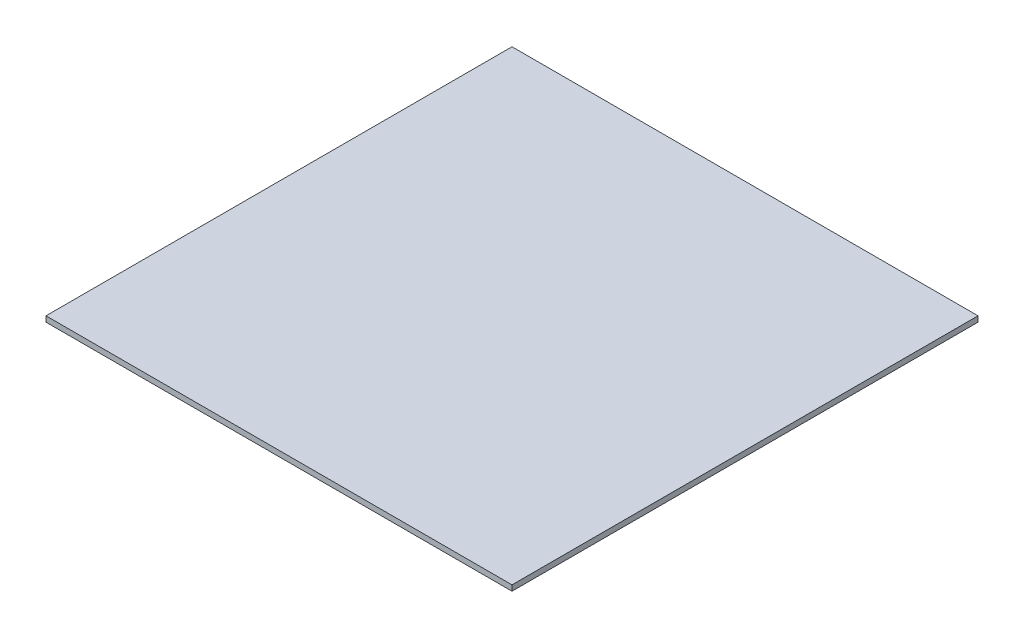
ISO-10303-21;
HEADER;
FILE_DESCRIPTION(('STEP AP214'),'2;1');
FILE_NAME('part.step','',(''),(''),'','','');
FILE_SCHEMA(('AUTOMOTIVE_DESIGN { 1 0 10303 214 1 1 1 1 }'));
ENDSEC;
DATA;
#1=APPLICATION_CONTEXT('core data for automotive mechanical design processes');
#2=APPLICATION_PROTOCOL_DEFINITION('international standard','automotive_design',2000,#1);
#3=PRODUCT_CONTEXT('',#1,'mechanical');
#4=PRODUCT('Part','Part','',(#3));
#5=PRODUCT_RELATED_PRODUCT_CATEGORY('part','',(#4));
#6=PRODUCT_DEFINITION_FORMATION('','',#4);
#7=PRODUCT_DEFINITION_CONTEXT('part definition',#1,'design');
#8=PRODUCT_DEFINITION('design','',#6,#7);
#9=PRODUCT_DEFINITION_SHAPE('','',#8);
#10=(LENGTH_UNIT() NAMED_UNIT(*) SI_UNIT(.MILLI.,.METRE.));
#11=(NAMED_UNIT(*) PLANE_ANGLE_UNIT() SI_UNIT($,.RADIAN.));
#12=(NAMED_UNIT(*) SI_UNIT($,.STERADIAN.) SOLID_ANGLE_UNIT());
#13=UNCERTAINTY_MEASURE_WITH_UNIT(LENGTH_MEASURE(1.E-05),#10,'distance_accuracy_value','');
#14=(GEOMETRIC_REPRESENTATION_CONTEXT(3) GLOBAL_UNCERTAINTY_ASSIGNED_CONTEXT((#13)) GLOBAL_UNIT_ASSIGNED_CONTEXT((#10,
#11,#12)) REPRESENTATION_CONTEXT('',''));
#15=CARTESIAN_POINT('',(0.,0.,0.));
#16=DIRECTION('',(0.,0.,1.));
#17=DIRECTION('',(1.,0.,0.));
#18=AXIS2_PLACEMENT_3D('',#15,#16,#17);
#19=CARTESIAN_POINT('',(0.,1.5875,0.));
#20=DIRECTION('',(1.,0.,0.));
#21=DIRECTION('',(0.,0.,-1.));
#22=AXIS2_PLACEMENT_3D('',#19,#20,#21);
#23=PLANE('',#22);
#24=DIRECTION('',(0.,0.,1.));
#25=VECTOR('',#24,1.);
#26=CARTESIAN_POINT('',(0.,0.,0.));
#27=LINE('',#26,#25);
#28=CARTESIAN_POINT('',(0.,0.,-133.35));
#29=VERTEX_POINT('',#28);
#30=CARTESIAN_POINT('',(0.,0.,0.));
#31=VERTEX_POINT('',#30);
#32=EDGE_CURVE('E96',#29,#31,#27,.T.);
#33=ORIENTED_EDGE('',*,*,#32,.T.);
#34=DIRECTION('',(0.,-1.,0.));
#35=VECTOR('',#34,1.);
#36=CARTESIAN_POINT('',(0.,1.5875,0.));
#37=LINE('',#36,#35);
#38=CARTESIAN_POINT('',(0.,1.5875,0.));
#39=VERTEX_POINT('',#38);
#40=EDGE_CURVE('E11',#39,#31,#37,.T.);
#41=ORIENTED_EDGE('',*,*,#40,.F.);
#42=DIRECTION('',(0.,0.,1.));
#43=VECTOR('',#42,1.);
#44=CARTESIAN_POINT('',(0.,1.5875,0.));
#45=LINE('',#44,#43);
#46=CARTESIAN_POINT('',(0.,1.5875,-133.35));
#47=VERTEX_POINT('',#46);
#48=EDGE_CURVE('E84',#47,#39,#45,.T.);
#49=ORIENTED_EDGE('',*,*,#48,.F.);
#50=DIRECTION('',(0.,-1.,0.));
#51=VECTOR('',#50,1.);
#52=CARTESIAN_POINT('',(0.,1.5875,-133.35));
#53=LINE('',#52,#51);
#54=EDGE_CURVE('E92',#47,#29,#53,.T.);
#55=ORIENTED_EDGE('',*,*,#54,.T.);
#56=EDGE_LOOP('',(#33,#41,#49,#55));
#57=FACE_BOUND('',#56,.T.);
#58=ADVANCED_FACE('F33',(#57),#23,.F.);
#59=CARTESIAN_POINT('',(0.,1.5875,0.));
#60=DIRECTION('',(0.,0.,-1.));
#61=DIRECTION('',(-1.,0.,0.));
#62=AXIS2_PLACEMENT_3D('',#59,#60,#61);
#63=PLANE('',#62);
#64=DIRECTION('',(1.,0.,0.));
#65=VECTOR('',#64,1.);
#66=CARTESIAN_POINT('',(0.,0.,0.));
#67=LINE('',#66,#65);
#68=CARTESIAN_POINT('',(133.35,0.,0.));
#69=VERTEX_POINT('',#68);
#70=EDGE_CURVE('E88',#31,#69,#67,.T.);
#71=ORIENTED_EDGE('',*,*,#70,.T.);
#72=DIRECTION('',(0.,-1.,0.));
#73=VECTOR('',#72,1.);
#74=CARTESIAN_POINT('',(133.35,1.5875,0.));
#75=LINE('',#74,#73);
#76=CARTESIAN_POINT('',(133.35,1.5875,0.));
#77=VERTEX_POINT('',#76);
#78=EDGE_CURVE('E41',#77,#69,#75,.T.);
#79=ORIENTED_EDGE('',*,*,#78,.F.);
#80=DIRECTION('',(1.,0.,0.));
#81=VECTOR('',#80,1.);
#82=CARTESIAN_POINT('',(0.,1.5875,0.));
#83=LINE('',#82,#81);
#84=EDGE_CURVE('E79',#39,#77,#83,.T.);
#85=ORIENTED_EDGE('',*,*,#84,.F.);
#86=ORIENTED_EDGE('',*,*,#40,.T.);
#87=EDGE_LOOP('',(#71,#79,#85,#86));
#88=FACE_BOUND('',#87,.T.);
#89=ADVANCED_FACE('F87',(#88),#63,.F.);
#90=CARTESIAN_POINT('',(133.35,1.5875,0.));
#91=DIRECTION('',(-1.,0.,0.));
#92=DIRECTION('',(0.,0.,1.));
#93=AXIS2_PLACEMENT_3D('',#90,#91,#92);
#94=PLANE('',#93);
#95=DIRECTION('',(0.,0.,-1.));
#96=VECTOR('',#95,1.);
#97=CARTESIAN_POINT('',(133.35,0.,0.));
#98=LINE('',#97,#96);
#99=CARTESIAN_POINT('',(133.35,0.,-133.35));
#100=VERTEX_POINT('',#99);
#101=EDGE_CURVE('E66',#69,#100,#98,.T.);
#102=ORIENTED_EDGE('',*,*,#101,.T.);
#103=DIRECTION('',(0.,-1.,0.));
#104=VECTOR('',#103,1.);
#105=CARTESIAN_POINT('',(133.35,1.5875,-133.35));
#106=LINE('',#105,#104);
#107=CARTESIAN_POINT('',(133.35,1.5875,-133.35));
#108=VERTEX_POINT('',#107);
#109=EDGE_CURVE('E89',#108,#100,#106,.T.);
#110=ORIENTED_EDGE('',*,*,#109,.F.);
#111=DIRECTION('',(0.,0.,-1.));
#112=VECTOR('',#111,1.);
#113=CARTESIAN_POINT('',(133.35,1.5875,0.));
#114=LINE('',#113,#112);
#115=EDGE_CURVE('E82',#77,#108,#114,.T.);
#116=ORIENTED_EDGE('',*,*,#115,.F.);
#117=ORIENTED_EDGE('',*,*,#78,.T.);
#118=EDGE_LOOP('',(#102,#110,#116,#117));
#119=FACE_BOUND('',#118,.T.);
#120=ADVANCED_FACE('F90',(#119),#94,.F.);
#121=CARTESIAN_POINT('',(0.,1.5875,-133.35));
#122=DIRECTION('',(0.,0.,1.));
#123=DIRECTION('',(1.,0.,0.));
#124=AXIS2_PLACEMENT_3D('',#121,#122,#123);
#125=PLANE('',#124);
#126=DIRECTION('',(-1.,0.,0.));
#127=VECTOR('',#126,1.);
#128=CARTESIAN_POINT('',(0.,0.,-133.35));
#129=LINE('',#128,#127);
#130=EDGE_CURVE('E72',#100,#29,#129,.T.);
#131=ORIENTED_EDGE('',*,*,#130,.T.);
#132=ORIENTED_EDGE('',*,*,#54,.F.);
#133=DIRECTION('',(-1.,0.,0.));
#134=VECTOR('',#133,1.);
#135=CARTESIAN_POINT('',(0.,1.5875,-133.35));
#136=LINE('',#135,#134);
#137=EDGE_CURVE('E49',#108,#47,#136,.T.);
#138=ORIENTED_EDGE('',*,*,#137,.F.);
#139=ORIENTED_EDGE('',*,*,#109,.T.);
#140=EDGE_LOOP('',(#131,#132,#138,#139));
#141=FACE_BOUND('',#140,.T.);
#142=ADVANCED_FACE('F103',(#141),#125,.F.);
#143=CARTESIAN_POINT('',(0.,1.5875,0.));
#144=DIRECTION('',(0.,-1.,0.));
#145=DIRECTION('',(0.,0.,-1.));
#146=AXIS2_PLACEMENT_3D('',#143,#144,#145);
#147=PLANE('',#146);
#148=ORIENTED_EDGE('',*,*,#48,.T.);
#149=ORIENTED_EDGE('',*,*,#84,.T.);
#150=ORIENTED_EDGE('',*,*,#115,.T.);
#151=ORIENTED_EDGE('',*,*,#137,.T.);
#152=EDGE_LOOP('',(#148,#149,#150,#151));
#153=FACE_BOUND('',#152,.T.);
#154=ADVANCED_FACE('F80',(#153),#147,.F.);
#155=CARTESIAN_POINT('',(0.,0.,0.));
#156=DIRECTION('',(0.,-1.,0.));
#157=DIRECTION('',(0.,0.,-1.));
#158=AXIS2_PLACEMENT_3D('',#155,#156,#157);
#159=PLANE('',#158);
#160=ORIENTED_EDGE('',*,*,#32,.F.);
#161=ORIENTED_EDGE('',*,*,#130,.F.);
#162=ORIENTED_EDGE('',*,*,#101,.F.);
#163=ORIENTED_EDGE('',*,*,#70,.F.);
#164=EDGE_LOOP('',(#160,#161,#162,#163));
#165=FACE_BOUND('',#164,.T.);
#166=ADVANCED_FACE('F106',(#165),#159,.T.);
#167=CLOSED_SHELL('',(#58,#89,#120,#142,#154,#166));
#168=MANIFOLD_SOLID_BREP('B2',#167);
#169=ADVANCED_BREP_SHAPE_REPRESENTATION('',(#18,#168),#14);
#170=SHAPE_DEFINITION_REPRESENTATION(#9,#169);
ENDSEC;
END-ISO-10303-21;
